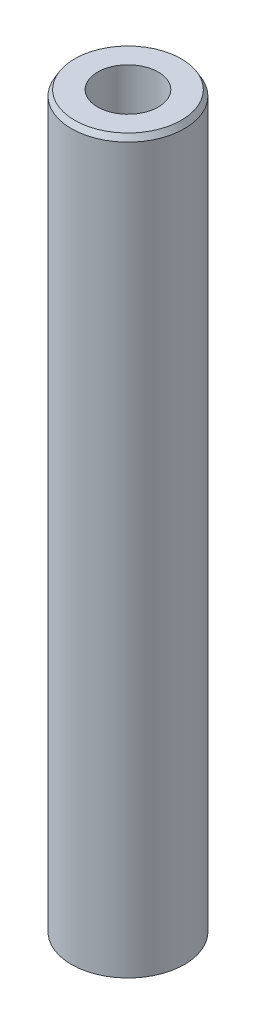
ISO-10303-21;
HEADER;
FILE_DESCRIPTION(('STEP AP214'),'2;1');
FILE_NAME('part.step','',(''),(''),'','','');
FILE_SCHEMA(('AUTOMOTIVE_DESIGN { 1 0 10303 214 1 1 1 1 }'));
ENDSEC;
DATA;
#1=APPLICATION_CONTEXT('core data for automotive mechanical design processes');
#2=APPLICATION_PROTOCOL_DEFINITION('international standard','automotive_design',2000,#1);
#3=PRODUCT_CONTEXT('',#1,'mechanical');
#4=PRODUCT('Part','Part','',(#3));
#5=PRODUCT_RELATED_PRODUCT_CATEGORY('part','',(#4));
#6=PRODUCT_DEFINITION_FORMATION('','',#4);
#7=PRODUCT_DEFINITION_CONTEXT('part definition',#1,'design');
#8=PRODUCT_DEFINITION('design','',#6,#7);
#9=PRODUCT_DEFINITION_SHAPE('','',#8);
#10=(LENGTH_UNIT() NAMED_UNIT(*) SI_UNIT(.MILLI.,.METRE.));
#11=(NAMED_UNIT(*) PLANE_ANGLE_UNIT() SI_UNIT($,.RADIAN.));
#12=(NAMED_UNIT(*) SI_UNIT($,.STERADIAN.) SOLID_ANGLE_UNIT());
#13=UNCERTAINTY_MEASURE_WITH_UNIT(LENGTH_MEASURE(1.E-05),#10,'distance_accuracy_value','');
#14=(GEOMETRIC_REPRESENTATION_CONTEXT(3) GLOBAL_UNCERTAINTY_ASSIGNED_CONTEXT((#13)) GLOBAL_UNIT_ASSIGNED_CONTEXT((#10,
#11,#12)) REPRESENTATION_CONTEXT('',''));
#15=CARTESIAN_POINT('',(0.,0.,0.));
#16=DIRECTION('',(0.,0.,1.));
#17=DIRECTION('',(1.,0.,0.));
#18=AXIS2_PLACEMENT_3D('',#15,#16,#17);
#19=CARTESIAN_POINT('',(0.,356.323004634447,0.));
#20=DIRECTION('',(0.,-1.,0.));
#21=DIRECTION('',(0.,0.,-1.));
#22=AXIS2_PLACEMENT_3D('',#19,#20,#21);
#23=CYLINDRICAL_SURFACE('',#22,27.5);
#24=CARTESIAN_POINT('',(0.,353.593433750579,0.));
#25=DIRECTION('',(0.,1.,0.));
#26=DIRECTION('',(0.,0.,1.));
#27=AXIS2_PLACEMENT_3D('',#24,#25,#26);
#28=CIRCLE('',#27,27.5);
#29=CARTESIAN_POINT('',(0.,353.593433750579,27.5));
#30=VERTEX_POINT('',#29);
#31=EDGE_CURVE('E50',#30,#30,#28,.F.);
#32=ORIENTED_EDGE('',*,*,#31,.T.);
#33=EDGE_LOOP('',(#32));
#34=FACE_BOUND('',#33,.T.);
#35=CARTESIAN_POINT('',(0.,1.57591848457334,0.));
#36=DIRECTION('',(0.,1.,0.));
#37=DIRECTION('',(0.,0.,1.));
#38=AXIS2_PLACEMENT_3D('',#35,#36,#37);
#39=CIRCLE('',#38,27.5);
#40=CARTESIAN_POINT('',(0.,1.57591848457334,27.5));
#41=VERTEX_POINT('',#40);
#42=EDGE_CURVE('E51',#41,#41,#39,.T.);
#43=ORIENTED_EDGE('',*,*,#42,.T.);
#44=EDGE_LOOP('',(#43));
#45=FACE_BOUND('',#44,.T.);
#46=ADVANCED_FACE('F39',(#34,#45),#23,.T.);
#47=CARTESIAN_POINT('',(0.,356.323004634447,0.));
#48=DIRECTION('',(0.,1.,0.));
#49=DIRECTION('',(0.,0.,1.));
#50=AXIS2_PLACEMENT_3D('',#47,#48,#49);
#51=PLANE('',#50);
#52=CARTESIAN_POINT('',(0.,356.323004634447,0.));
#53=DIRECTION('',(0.,1.,0.));
#54=DIRECTION('',(0.,0.,1.));
#55=AXIS2_PLACEMENT_3D('',#52,#53,#54);
#56=CIRCLE('',#55,25.9240815154266);
#57=CARTESIAN_POINT('',(0.,356.323004634447,25.9240815154266));
#58=VERTEX_POINT('',#57);
#59=EDGE_CURVE('E54',#58,#58,#56,.T.);
#60=ORIENTED_EDGE('',*,*,#59,.T.);
#61=EDGE_LOOP('',(#60));
#62=FACE_BOUND('',#61,.T.);
#63=CARTESIAN_POINT('',(0.,356.323004634447,0.));
#64=DIRECTION('',(0.,1.,0.));
#65=DIRECTION('',(0.,0.,1.));
#66=AXIS2_PLACEMENT_3D('',#63,#64,#65);
#67=CIRCLE('',#66,14.7516434239324);
#68=CARTESIAN_POINT('',(0.,356.323004634447,14.7516434239324));
#69=VERTEX_POINT('',#68);
#70=EDGE_CURVE('E58',#69,#69,#67,.T.);
#71=ORIENTED_EDGE('',*,*,#70,.F.);
#72=EDGE_LOOP('',(#71));
#73=FACE_BOUND('',#72,.T.);
#74=ADVANCED_FACE('F69',(#62,#73),#51,.T.);
#75=CARTESIAN_POINT('',(0.,0.,0.));
#76=DIRECTION('',(0.,1.,0.));
#77=DIRECTION('',(0.,0.,1.));
#78=AXIS2_PLACEMENT_3D('',#75,#76,#77);
#79=PLANE('',#78);
#80=CARTESIAN_POINT('',(0.,0.,0.));
#81=DIRECTION('',(0.,1.,0.));
#82=DIRECTION('',(0.,0.,1.));
#83=AXIS2_PLACEMENT_3D('',#80,#81,#82);
#84=CIRCLE('',#83,24.7704291161321);
#85=CARTESIAN_POINT('',(0.,0.,24.7704291161321));
#86=VERTEX_POINT('',#85);
#87=EDGE_CURVE('E10',#86,#86,#84,.F.);
#88=ORIENTED_EDGE('',*,*,#87,.T.);
#89=EDGE_LOOP('',(#88));
#90=FACE_BOUND('',#89,.T.);
#91=CARTESIAN_POINT('',(0.,0.,0.));
#92=DIRECTION('',(0.,1.,0.));
#93=DIRECTION('',(0.,0.,1.));
#94=AXIS2_PLACEMENT_3D('',#91,#92,#93);
#95=CIRCLE('',#94,14.7516434239324);
#96=CARTESIAN_POINT('',(0.,0.,14.7516434239324));
#97=VERTEX_POINT('',#96);
#98=EDGE_CURVE('E63',#97,#97,#95,.T.);
#99=ORIENTED_EDGE('',*,*,#98,.T.);
#100=EDGE_LOOP('',(#99));
#101=FACE_BOUND('',#100,.T.);
#102=ADVANCED_FACE('F75',(#90,#101),#79,.F.);
#103=CARTESIAN_POINT('',(0.,356.323004634447,0.));
#104=DIRECTION('',(0.,-1.,0.));
#105=DIRECTION('',(0.,0.,-1.));
#106=AXIS2_PLACEMENT_3D('',#103,#104,#105);
#107=CYLINDRICAL_SURFACE('',#106,14.7516434239324);
#108=ORIENTED_EDGE('',*,*,#70,.T.);
#109=EDGE_LOOP('',(#108));
#110=FACE_BOUND('',#109,.T.);
#111=ORIENTED_EDGE('',*,*,#98,.F.);
#112=EDGE_LOOP('',(#111));
#113=FACE_BOUND('',#112,.T.);
#114=ADVANCED_FACE('F70',(#110,#113),#107,.F.);
#115=CARTESIAN_POINT('',(0.,356.323004634447,0.));
#116=DIRECTION('',(0.,-1.,0.));
#117=DIRECTION('',(0.,0.,-1.));
#118=AXIS2_PLACEMENT_3D('',#115,#116,#117);
#119=CONICAL_SURFACE('',#118,25.9240815154266,0.523598775598295);
#120=ORIENTED_EDGE('',*,*,#31,.F.);
#121=EDGE_LOOP('',(#120));
#122=FACE_BOUND('',#121,.T.);
#123=ORIENTED_EDGE('',*,*,#59,.F.);
#124=EDGE_LOOP('',(#123));
#125=FACE_BOUND('',#124,.T.);
#126=ADVANCED_FACE('F81',(#122,#125),#119,.T.);
#127=CARTESIAN_POINT('',(0.,1.57591848457334,0.));
#128=DIRECTION('',(0.,1.,0.));
#129=DIRECTION('',(0.,0.,1.));
#130=AXIS2_PLACEMENT_3D('',#127,#128,#129);
#131=CONICAL_SURFACE('',#130,27.5,1.04719755119659);
#132=CARTESIAN_POINT('',(0.,0.,24.7704291161321));
#133=CARTESIAN_POINT('',(0.,0.016415817547638,24.7988621461724));
#134=CARTESIAN_POINT('',(0.,0.0328316350952771,24.8272951762127));
#135=CARTESIAN_POINT('',(0.,0.0656632701905554,24.8841612362933));
#136=CARTESIAN_POINT('',(0.,0.0820790877381946,24.9125942663335));
#137=CARTESIAN_POINT('',(0.,0.114910722833472,24.9694603264141));
#138=CARTESIAN_POINT('',(0.,0.131326540381111,24.9978933564544));
#139=CARTESIAN_POINT('',(0.,0.164158175476389,25.054759416535));
#140=CARTESIAN_POINT('',(0.,0.180573993024028,25.0831924465753));
#141=CARTESIAN_POINT('',(0.,0.213405628119306,25.1400585066559));
#142=CARTESIAN_POINT('',(0.,0.229821445666945,25.1684915366962));
#143=CARTESIAN_POINT('',(0.,0.262653080762222,25.2253575967767));
#144=CARTESIAN_POINT('',(0.,0.279068898309861,25.253790626817));
#145=CARTESIAN_POINT('',(0.,0.311900533405139,25.3106566868976));
#146=CARTESIAN_POINT('',(0.,0.328316350952778,25.3390897169379));
#147=CARTESIAN_POINT('',(0.,0.361147986048056,25.3959557770185));
#148=CARTESIAN_POINT('',(0.,0.377563803595695,25.4243888070588));
#149=CARTESIAN_POINT('',(0.,0.410395438690972,25.4812548671394));
#150=CARTESIAN_POINT('',(0.,0.426811256238611,25.5096878971796));
#151=CARTESIAN_POINT('',(0.,0.459642891333889,25.5665539572602));
#152=CARTESIAN_POINT('',(0.,0.476058708881528,25.5949869873005));
#153=CARTESIAN_POINT('',(0.,0.508890343976806,25.6518530473811));
#154=CARTESIAN_POINT('',(0.,0.525306161524445,25.6802860774214));
#155=CARTESIAN_POINT('',(0.,0.558137796619723,25.737152137502));
#156=CARTESIAN_POINT('',(0.,0.574553614167361,25.7655851675423));
#157=CARTESIAN_POINT('',(0.,0.607385249262639,25.8224512276228));
#158=CARTESIAN_POINT('',(0.,0.623801066810279,25.8508842576631));
#159=CARTESIAN_POINT('',(0.,0.656632701905557,25.9077503177437));
#160=CARTESIAN_POINT('',(0.,0.673048519453195,25.936183347784));
#161=CARTESIAN_POINT('',(0.,0.705880154548473,25.9930494078646));
#162=CARTESIAN_POINT('',(0.,0.722295972096112,26.0214824379049));
#163=CARTESIAN_POINT('',(0.,0.75512760719139,26.0783484979855));
#164=CARTESIAN_POINT('',(0.,0.771543424739029,26.1067815280258));
#165=CARTESIAN_POINT('',(0.,0.804375059834306,26.1636475881063));
#166=CARTESIAN_POINT('',(0.,0.820790877381945,26.1920806181466));
#167=CARTESIAN_POINT('',(0.,0.853622512477223,26.2489466782272));
#168=CARTESIAN_POINT('',(0.,0.870038330024862,26.2773797082675));
#169=CARTESIAN_POINT('',(0.,0.90286996512014,26.3342457683481));
#170=CARTESIAN_POINT('',(0.,0.919285782667779,26.3626787983884));
#171=CARTESIAN_POINT('',(0.,0.952117417763056,26.419544858469));
#172=CARTESIAN_POINT('',(0.,0.968533235310696,26.4479778885092));
#173=CARTESIAN_POINT('',(0.,1.00136487040597,26.5048439485898));
#174=CARTESIAN_POINT('',(0.,1.01778068795361,26.5332769786301));
#175=CARTESIAN_POINT('',(0.,1.05061232304889,26.5901430387107));
#176=CARTESIAN_POINT('',(0.,1.06702814059653,26.618576068751));
#177=CARTESIAN_POINT('',(0.,1.09985977569181,26.6754421288316));
#178=CARTESIAN_POINT('',(0.,1.11627559323945,26.7038751588719));
#179=CARTESIAN_POINT('',(0.,1.14910722833472,26.7607412189524));
#180=CARTESIAN_POINT('',(0.,1.16552304588236,26.7891742489927));
#181=CARTESIAN_POINT('',(0.,1.19835468097764,26.8460403090733));
#182=CARTESIAN_POINT('',(0.,1.21477049852528,26.8744733391136));
#183=CARTESIAN_POINT('',(0.,1.24760213362056,26.9313393991942));
#184=CARTESIAN_POINT('',(0.,1.2640179511682,26.9597724292345));
#185=CARTESIAN_POINT('',(0.,1.29684958626347,27.0166384893151));
#186=CARTESIAN_POINT('',(0.,1.31326540381111,27.0450715193553));
#187=CARTESIAN_POINT('',(0.,1.34609703890639,27.1019375794359));
#188=CARTESIAN_POINT('',(0.,1.36251285645403,27.1303706094762));
#189=CARTESIAN_POINT('',(0.,1.39534449154931,27.1872366695568));
#190=CARTESIAN_POINT('',(0.,1.41176030909695,27.2156696995971));
#191=CARTESIAN_POINT('',(0.,1.44459194419222,27.2725357596777));
#192=CARTESIAN_POINT('',(0.,1.46100776173986,27.300968789718));
#193=CARTESIAN_POINT('',(0.,1.49383939683514,27.3578348497986));
#194=CARTESIAN_POINT('',(0.,1.51025521438278,27.3862678798388));
#195=CARTESIAN_POINT('',(0.,1.54308684947806,27.4431339399194));
#196=CARTESIAN_POINT('',(0.,1.5595026670257,27.4715669699597));
#197=CARTESIAN_POINT('',(0.,1.57591848457334,27.5));
#198=B_SPLINE_CURVE_WITH_KNOTS('',3,(#132,#133,#134,#135,#136,#137,#138,#139,#140,#141,#142,
#143,#144,#145,#146,#147,#148,#149,#150,#151,#152,#153,#154,#155,#156,#157,#158,#159,#160,#161,
#162,#163,#164,#165,#166,#167,#168,#169,#170,#171,#172,#173,#174,#175,#176,#177,#178,#179,#180,
#181,#182,#183,#184,#185,#186,#187,#188,#189,#190,#191,#192,#193,#194,#195,#196,#197),
.UNSPECIFIED.,.F.,.F.,(4,2,2,2,2,2,2,2,2,2,2,2,2,2,2,2,2,2,2,2,2,2,2,2,2,2,2,2,2,2,2,2,4),(0.,
0.0984949052858327,0.196989810571662,0.295484715857495,0.393979621143328,0.49247452642916,
0.590969431714993,0.689464337000823,0.787959242286655,0.886454147572488,0.984949052858321,
1.08344395814415,1.18193886342999,1.28043376871582,1.37892867400165,1.47742357928748,
1.57591848457331,1.67441338985915,1.77290829514498,1.87140320043081,1.96989810571664,
2.06839301100247,2.16688791628831,2.26538282157414,2.36387772685997,2.4623726321458,
2.56086753743163,2.65936244271747,2.7578573480033,2.85635225328913,2.95484715857496,
3.05334206386079,3.15183696914663),.UNSPECIFIED.);
#199=EDGE_CURVE('BSEAM45',#86,#41,#198,.T.);
#200=ORIENTED_EDGE('',*,*,#87,.F.);
#201=ORIENTED_EDGE('',*,*,#42,.F.);
#202=ORIENTED_EDGE('',*,*,#199,.T.);
#203=ORIENTED_EDGE('',*,*,#199,.F.);
#204=EDGE_LOOP('',(#200,#202,#201,#203));
#205=FACE_BOUND('',#204,.T.);
#206=ADVANCED_FACE('F45',(#205),#131,.T.);
#207=CLOSED_SHELL('',(#46,#74,#102,#114,#126,#206));
#208=MANIFOLD_SOLID_BREP('B2',#207);
#209=ADVANCED_BREP_SHAPE_REPRESENTATION('',(#18,#208),#14);
#210=SHAPE_DEFINITION_REPRESENTATION(#9,#209);
ENDSEC;
END-ISO-10303-21;
